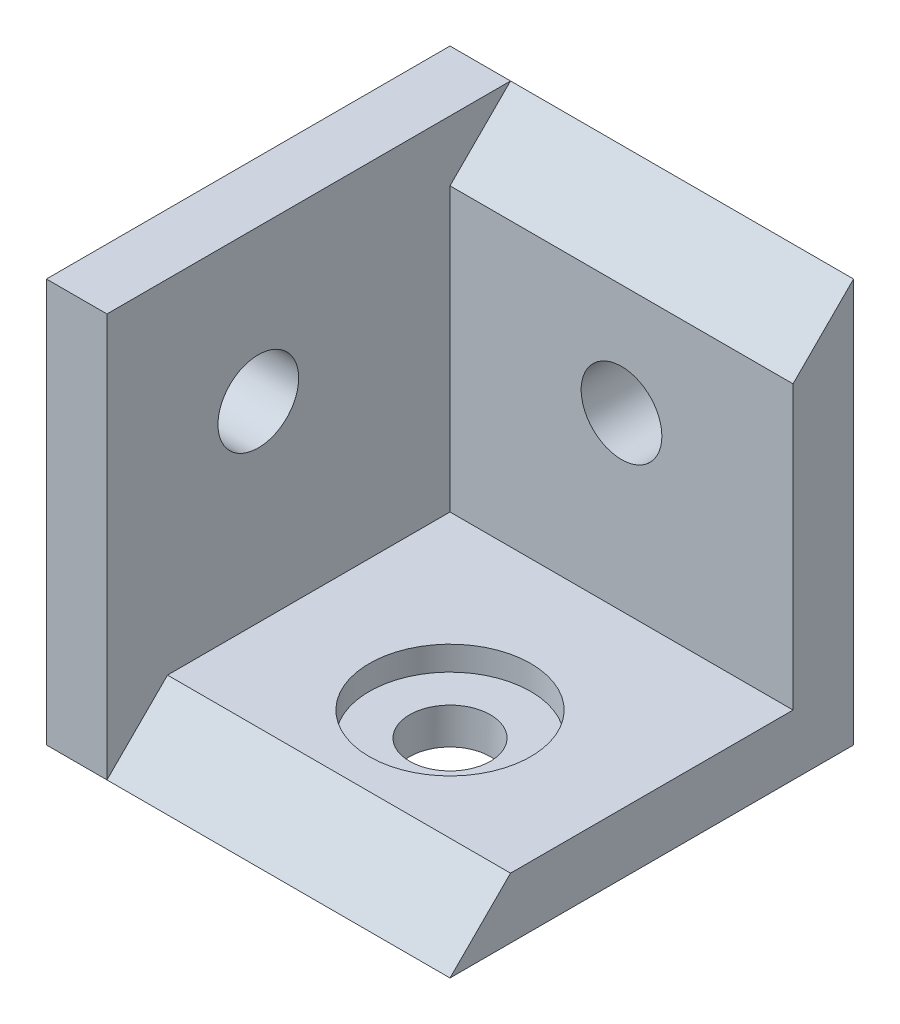
ISO-10303-21;
HEADER;
FILE_DESCRIPTION(('STEP AP214'),'2;1');
FILE_NAME('part.step','',(''),(''),'','','');
FILE_SCHEMA(('AUTOMOTIVE_DESIGN { 1 0 10303 214 1 1 1 1 }'));
ENDSEC;
DATA;
#1=APPLICATION_CONTEXT('core data for automotive mechanical design processes');
#2=APPLICATION_PROTOCOL_DEFINITION('international standard','automotive_design',2000,#1);
#3=PRODUCT_CONTEXT('',#1,'mechanical');
#4=PRODUCT('Part','Part','',(#3));
#5=PRODUCT_RELATED_PRODUCT_CATEGORY('part','',(#4));
#6=PRODUCT_DEFINITION_FORMATION('','',#4);
#7=PRODUCT_DEFINITION_CONTEXT('part definition',#1,'design');
#8=PRODUCT_DEFINITION('design','',#6,#7);
#9=PRODUCT_DEFINITION_SHAPE('','',#8);
#10=(LENGTH_UNIT() NAMED_UNIT(*) SI_UNIT(.MILLI.,.METRE.));
#11=(NAMED_UNIT(*) PLANE_ANGLE_UNIT() SI_UNIT($,.RADIAN.));
#12=(NAMED_UNIT(*) SI_UNIT($,.STERADIAN.) SOLID_ANGLE_UNIT());
#13=UNCERTAINTY_MEASURE_WITH_UNIT(LENGTH_MEASURE(1.E-05),#10,'distance_accuracy_value','');
#14=(GEOMETRIC_REPRESENTATION_CONTEXT(3) GLOBAL_UNCERTAINTY_ASSIGNED_CONTEXT((#13)) GLOBAL_UNIT_ASSIGNED_CONTEXT((#10,
#11,#12)) REPRESENTATION_CONTEXT('',''));
#15=CARTESIAN_POINT('',(0.,0.,0.));
#16=DIRECTION('',(0.,0.,1.));
#17=DIRECTION('',(1.,0.,0.));
#18=AXIS2_PLACEMENT_3D('',#15,#16,#17);
#19=CARTESIAN_POINT('',(11.5,-14.,-8.5));
#20=DIRECTION('',(0.,1.,0.));
#21=DIRECTION('',(0.,0.,1.));
#22=AXIS2_PLACEMENT_3D('',#19,#20,#21);
#23=CYLINDRICAL_SURFACE('',#22,2.);
#24=CARTESIAN_POINT('',(11.5,0.,-8.5));
#25=DIRECTION('',(0.,-1.,0.));
#26=DIRECTION('',(0.,0.,-1.));
#27=AXIS2_PLACEMENT_3D('',#24,#25,#26);
#28=CIRCLE('',#27,2.);
#29=CARTESIAN_POINT('',(11.5,0.,-10.5));
#30=VERTEX_POINT('',#29);
#31=EDGE_CURVE('E377',#30,#30,#28,.T.);
#32=ORIENTED_EDGE('',*,*,#31,.T.);
#33=EDGE_LOOP('',(#32));
#34=FACE_BOUND('',#33,.T.);
#35=CARTESIAN_POINT('',(11.5,1.8,-8.5));
#36=DIRECTION('',(0.,1.,0.));
#37=DIRECTION('',(0.,0.,1.));
#38=AXIS2_PLACEMENT_3D('',#35,#36,#37);
#39=CIRCLE('',#38,2.);
#40=CARTESIAN_POINT('',(11.5,1.8,-6.5));
#41=VERTEX_POINT('',#40);
#42=EDGE_CURVE('E49',#41,#41,#39,.F.);
#43=ORIENTED_EDGE('',*,*,#42,.F.);
#44=EDGE_LOOP('',(#43));
#45=FACE_BOUND('',#44,.T.);
#46=ADVANCED_FACE('F45',(#34,#45),#23,.F.);
#47=CARTESIAN_POINT('',(3.,20.,-20.));
#48=DIRECTION('',(0.,-0.707106781186547,-0.707106781186547));
#49=DIRECTION('',(0.,0.707106781186548,-0.707106781186548));
#50=AXIS2_PLACEMENT_3D('',#47,#48,#49);
#51=PLANE('',#50);
#52=DIRECTION('',(0.,0.707106781186548,-0.707106781186548));
#53=VECTOR('',#52,1.);
#54=CARTESIAN_POINT('',(3.,20.,-20.));
#55=LINE('',#54,#53);
#56=CARTESIAN_POINT('',(3.,17.,-17.));
#57=VERTEX_POINT('',#56);
#58=CARTESIAN_POINT('',(3.,20.,-20.));
#59=VERTEX_POINT('',#58);
#60=EDGE_CURVE('E153',#57,#59,#55,.T.);
#61=ORIENTED_EDGE('',*,*,#60,.F.);
#62=DIRECTION('',(1.,0.,0.));
#63=VECTOR('',#62,1.);
#64=CARTESIAN_POINT('',(3.,17.,-17.));
#65=LINE('',#64,#63);
#66=CARTESIAN_POINT('',(20.,17.,-17.));
#67=VERTEX_POINT('',#66);
#68=EDGE_CURVE('E129',#57,#67,#65,.T.);
#69=ORIENTED_EDGE('',*,*,#68,.T.);
#70=DIRECTION('',(0.,0.707106781186548,-0.707106781186548));
#71=VECTOR('',#70,1.);
#72=CARTESIAN_POINT('',(20.,20.,-20.));
#73=LINE('',#72,#71);
#74=CARTESIAN_POINT('',(20.,20.,-20.));
#75=VERTEX_POINT('',#74);
#76=EDGE_CURVE('E146',#67,#75,#73,.T.);
#77=ORIENTED_EDGE('',*,*,#76,.T.);
#78=DIRECTION('',(-1.,0.,0.));
#79=VECTOR('',#78,1.);
#80=CARTESIAN_POINT('',(0.,20.,-20.));
#81=LINE('',#80,#79);
#82=EDGE_CURVE('E173',#75,#59,#81,.T.);
#83=ORIENTED_EDGE('',*,*,#82,.T.);
#84=EDGE_LOOP('',(#61,#69,#77,#83));
#85=FACE_BOUND('',#84,.T.);
#86=ADVANCED_FACE('F218',(#85),#51,.F.);
#87=CARTESIAN_POINT('',(0.,20.,0.));
#88=DIRECTION('',(0.,0.,-1.));
#89=DIRECTION('',(-1.,0.,0.));
#90=AXIS2_PLACEMENT_3D('',#87,#88,#89);
#91=PLANE('',#90);
#92=DIRECTION('',(0.,-1.,0.));
#93=VECTOR('',#92,1.);
#94=CARTESIAN_POINT('',(3.,0.,0.));
#95=LINE('',#94,#93);
#96=CARTESIAN_POINT('',(3.,20.,0.));
#97=VERTEX_POINT('',#96);
#98=CARTESIAN_POINT('',(3.,0.,0.));
#99=VERTEX_POINT('',#98);
#100=EDGE_CURVE('E69',#97,#99,#95,.T.);
#101=ORIENTED_EDGE('',*,*,#100,.F.);
#102=DIRECTION('',(1.,0.,0.));
#103=VECTOR('',#102,1.);
#104=CARTESIAN_POINT('',(0.,20.,0.));
#105=LINE('',#104,#103);
#106=CARTESIAN_POINT('',(0.,20.,0.));
#107=VERTEX_POINT('',#106);
#108=EDGE_CURVE('E167',#107,#97,#105,.T.);
#109=ORIENTED_EDGE('',*,*,#108,.F.);
#110=DIRECTION('',(0.,-1.,0.));
#111=VECTOR('',#110,1.);
#112=CARTESIAN_POINT('',(0.,20.,0.));
#113=LINE('',#112,#111);
#114=CARTESIAN_POINT('',(0.,0.,0.));
#115=VERTEX_POINT('',#114);
#116=EDGE_CURVE('E11',#107,#115,#113,.T.);
#117=ORIENTED_EDGE('',*,*,#116,.T.);
#118=DIRECTION('',(1.,0.,0.));
#119=VECTOR('',#118,1.);
#120=CARTESIAN_POINT('',(0.,0.,0.));
#121=LINE('',#120,#119);
#122=EDGE_CURVE('E181',#115,#99,#121,.T.);
#123=ORIENTED_EDGE('',*,*,#122,.T.);
#124=EDGE_LOOP('',(#101,#109,#117,#123));
#125=FACE_BOUND('',#124,.T.);
#126=ADVANCED_FACE('F224',(#125),#91,.F.);
#127=CARTESIAN_POINT('',(0.,20.,0.));
#128=DIRECTION('',(0.,-1.,0.));
#129=DIRECTION('',(0.,0.,-1.));
#130=AXIS2_PLACEMENT_3D('',#127,#128,#129);
#131=PLANE('',#130);
#132=DIRECTION('',(0.,0.,1.));
#133=VECTOR('',#132,1.);
#134=CARTESIAN_POINT('',(3.,20.,0.));
#135=LINE('',#134,#133);
#136=EDGE_CURVE('E147',#59,#97,#135,.T.);
#137=ORIENTED_EDGE('',*,*,#136,.F.);
#138=CARTESIAN_POINT('',(0.,20.,-20.));
#139=VERTEX_POINT('',#138);
#140=EDGE_CURVE('E172',#59,#139,#81,.T.);
#141=ORIENTED_EDGE('',*,*,#140,.T.);
#142=DIRECTION('',(0.,0.,1.));
#143=VECTOR('',#142,1.);
#144=CARTESIAN_POINT('',(0.,20.,0.));
#145=LINE('',#144,#143);
#146=EDGE_CURVE('E163',#139,#107,#145,.T.);
#147=ORIENTED_EDGE('',*,*,#146,.T.);
#148=ORIENTED_EDGE('',*,*,#108,.T.);
#149=EDGE_LOOP('',(#137,#141,#147,#148));
#150=FACE_BOUND('',#149,.T.);
#151=ADVANCED_FACE('F225',(#150),#131,.F.);
#152=CARTESIAN_POINT('',(0.,20.,0.));
#153=DIRECTION('',(1.,0.,0.));
#154=DIRECTION('',(0.,0.,-1.));
#155=AXIS2_PLACEMENT_3D('',#152,#153,#154);
#156=PLANE('',#155);
#157=CARTESIAN_POINT('',(0.,12.5,-7.5));
#158=DIRECTION('',(1.,0.,0.));
#159=DIRECTION('',(0.,0.,-1.));
#160=AXIS2_PLACEMENT_3D('',#157,#158,#159);
#161=CIRCLE('',#160,2.);
#162=CARTESIAN_POINT('',(0.,12.5,-9.5));
#163=VERTEX_POINT('',#162);
#164=EDGE_CURVE('E137',#163,#163,#161,.T.);
#165=ORIENTED_EDGE('',*,*,#164,.T.);
#166=EDGE_LOOP('',(#165));
#167=FACE_BOUND('',#166,.T.);
#168=DIRECTION('',(0.,0.,1.));
#169=VECTOR('',#168,1.);
#170=CARTESIAN_POINT('',(0.,0.,0.));
#171=LINE('',#170,#169);
#172=CARTESIAN_POINT('',(0.,0.,-20.));
#173=VERTEX_POINT('',#172);
#174=EDGE_CURVE('E162',#173,#115,#171,.T.);
#175=ORIENTED_EDGE('',*,*,#174,.T.);
#176=ORIENTED_EDGE('',*,*,#116,.F.);
#177=ORIENTED_EDGE('',*,*,#146,.F.);
#178=DIRECTION('',(0.,-1.,0.));
#179=VECTOR('',#178,1.);
#180=CARTESIAN_POINT('',(0.,20.,-20.));
#181=LINE('',#180,#179);
#182=EDGE_CURVE('E177',#139,#173,#181,.T.);
#183=ORIENTED_EDGE('',*,*,#182,.T.);
#184=EDGE_LOOP('',(#175,#176,#177,#183));
#185=FACE_BOUND('',#184,.T.);
#186=ADVANCED_FACE('F47',(#167,#185),#156,.F.);
#187=CARTESIAN_POINT('',(20.,20.,0.));
#188=DIRECTION('',(-1.,0.,0.));
#189=DIRECTION('',(0.,0.,1.));
#190=AXIS2_PLACEMENT_3D('',#187,#188,#189);
#191=PLANE('',#190);
#192=ORIENTED_EDGE('',*,*,#76,.F.);
#193=DIRECTION('',(0.,1.,0.));
#194=VECTOR('',#193,1.);
#195=CARTESIAN_POINT('',(20.,3.,-17.));
#196=LINE('',#195,#194);
#197=CARTESIAN_POINT('',(20.,3.,-17.));
#198=VERTEX_POINT('',#197);
#199=EDGE_CURVE('E134',#198,#67,#196,.T.);
#200=ORIENTED_EDGE('',*,*,#199,.F.);
#201=DIRECTION('',(0.,0.,-1.));
#202=VECTOR('',#201,1.);
#203=CARTESIAN_POINT('',(20.,3.,-17.));
#204=LINE('',#203,#202);
#205=CARTESIAN_POINT('',(20.,3.,-3.));
#206=VERTEX_POINT('',#205);
#207=EDGE_CURVE('E121',#206,#198,#204,.T.);
#208=ORIENTED_EDGE('',*,*,#207,.F.);
#209=CARTESIAN_POINT('',(20.,0.,0.));
#210=VERTEX_POINT('',#209);
#211=EDGE_CURVE('E150',#210,#206,#73,.T.);
#212=ORIENTED_EDGE('',*,*,#211,.F.);
#213=DIRECTION('',(0.,0.,-1.));
#214=VECTOR('',#213,1.);
#215=CARTESIAN_POINT('',(20.,0.,0.));
#216=LINE('',#215,#214);
#217=CARTESIAN_POINT('',(20.,0.,-20.));
#218=VERTEX_POINT('',#217);
#219=EDGE_CURVE('E185',#210,#218,#216,.T.);
#220=ORIENTED_EDGE('',*,*,#219,.T.);
#221=DIRECTION('',(0.,-1.,0.));
#222=VECTOR('',#221,1.);
#223=CARTESIAN_POINT('',(20.,20.,-20.));
#224=LINE('',#223,#222);
#225=EDGE_CURVE('E55',#75,#218,#224,.T.);
#226=ORIENTED_EDGE('',*,*,#225,.F.);
#227=EDGE_LOOP('',(#192,#200,#208,#212,#220,#226));
#228=FACE_BOUND('',#227,.T.);
#229=ADVANCED_FACE('F219',(#228),#191,.F.);
#230=CARTESIAN_POINT('',(0.,20.,-20.));
#231=DIRECTION('',(0.,0.,1.));
#232=DIRECTION('',(1.,0.,0.));
#233=AXIS2_PLACEMENT_3D('',#230,#231,#232);
#234=PLANE('',#233);
#235=CARTESIAN_POINT('',(11.5,11.5,-20.));
#236=DIRECTION('',(0.,0.,1.));
#237=DIRECTION('',(1.,0.,0.));
#238=AXIS2_PLACEMENT_3D('',#235,#236,#237);
#239=CIRCLE('',#238,2.);
#240=CARTESIAN_POINT('',(13.5,11.5,-20.));
#241=VERTEX_POINT('',#240);
#242=EDGE_CURVE('E384',#241,#241,#239,.T.);
#243=ORIENTED_EDGE('',*,*,#242,.T.);
#244=EDGE_LOOP('',(#243));
#245=FACE_BOUND('',#244,.T.);
#246=DIRECTION('',(-1.,0.,0.));
#247=VECTOR('',#246,1.);
#248=CARTESIAN_POINT('',(0.,0.,-20.));
#249=LINE('',#248,#247);
#250=EDGE_CURVE('E168',#218,#173,#249,.T.);
#251=ORIENTED_EDGE('',*,*,#250,.T.);
#252=ORIENTED_EDGE('',*,*,#182,.F.);
#253=ORIENTED_EDGE('',*,*,#140,.F.);
#254=ORIENTED_EDGE('',*,*,#82,.F.);
#255=ORIENTED_EDGE('',*,*,#225,.T.);
#256=EDGE_LOOP('',(#251,#252,#253,#254,#255));
#257=FACE_BOUND('',#256,.T.);
#258=ADVANCED_FACE('F199',(#245,#257),#234,.F.);
#259=CARTESIAN_POINT('',(0.,0.,0.));
#260=DIRECTION('',(0.,-1.,0.));
#261=DIRECTION('',(0.,0.,-1.));
#262=AXIS2_PLACEMENT_3D('',#259,#260,#261);
#263=PLANE('',#262);
#264=ORIENTED_EDGE('',*,*,#31,.F.);
#265=EDGE_LOOP('',(#264));
#266=FACE_BOUND('',#265,.T.);
#267=ORIENTED_EDGE('',*,*,#174,.F.);
#268=ORIENTED_EDGE('',*,*,#250,.F.);
#269=ORIENTED_EDGE('',*,*,#219,.F.);
#270=DIRECTION('',(1.,0.,0.));
#271=VECTOR('',#270,1.);
#272=CARTESIAN_POINT('',(3.,0.,0.));
#273=LINE('',#272,#271);
#274=EDGE_CURVE('E156',#99,#210,#273,.T.);
#275=ORIENTED_EDGE('',*,*,#274,.F.);
#276=ORIENTED_EDGE('',*,*,#122,.F.);
#277=EDGE_LOOP('',(#267,#268,#269,#275,#276));
#278=FACE_BOUND('',#277,.T.);
#279=ADVANCED_FACE('F207',(#266,#278),#263,.T.);
#280=ORIENTED_EDGE('',*,*,#211,.T.);
#281=DIRECTION('',(-1.,0.,0.));
#282=VECTOR('',#281,1.);
#283=CARTESIAN_POINT('',(3.,3.,-3.));
#284=LINE('',#283,#282);
#285=CARTESIAN_POINT('',(3.,3.,-3.));
#286=VERTEX_POINT('',#285);
#287=EDGE_CURVE('E125',#206,#286,#284,.T.);
#288=ORIENTED_EDGE('',*,*,#287,.T.);
#289=EDGE_CURVE('E112',#99,#286,#55,.T.);
#290=ORIENTED_EDGE('',*,*,#289,.F.);
#291=ORIENTED_EDGE('',*,*,#274,.T.);
#292=EDGE_LOOP('',(#280,#288,#290,#291));
#293=FACE_BOUND('',#292,.T.);
#294=ADVANCED_FACE('F222',(#293),#51,.F.);
#295=CARTESIAN_POINT('',(3.,0.,0.));
#296=DIRECTION('',(1.,0.,0.));
#297=DIRECTION('',(0.,0.,-1.));
#298=AXIS2_PLACEMENT_3D('',#295,#296,#297);
#299=PLANE('',#298);
#300=CARTESIAN_POINT('',(3.,12.5,-7.5));
#301=DIRECTION('',(1.,0.,0.));
#302=DIRECTION('',(0.,0.,-1.));
#303=AXIS2_PLACEMENT_3D('',#300,#301,#302);
#304=CIRCLE('',#303,2.);
#305=CARTESIAN_POINT('',(3.,12.5,-9.5));
#306=VERTEX_POINT('',#305);
#307=EDGE_CURVE('E387',#306,#306,#304,.T.);
#308=ORIENTED_EDGE('',*,*,#307,.F.);
#309=EDGE_LOOP('',(#308));
#310=FACE_BOUND('',#309,.T.);
#311=ORIENTED_EDGE('',*,*,#289,.T.);
#312=DIRECTION('',(0.,0.,-1.));
#313=VECTOR('',#312,1.);
#314=CARTESIAN_POINT('',(3.,3.,-17.));
#315=LINE('',#314,#313);
#316=CARTESIAN_POINT('',(3.,3.,-17.));
#317=VERTEX_POINT('',#316);
#318=EDGE_CURVE('E109',#286,#317,#315,.T.);
#319=ORIENTED_EDGE('',*,*,#318,.T.);
#320=DIRECTION('',(0.,1.,0.));
#321=VECTOR('',#320,1.);
#322=CARTESIAN_POINT('',(3.,3.,-17.));
#323=LINE('',#322,#321);
#324=EDGE_CURVE('E62',#317,#57,#323,.T.);
#325=ORIENTED_EDGE('',*,*,#324,.T.);
#326=ORIENTED_EDGE('',*,*,#60,.T.);
#327=ORIENTED_EDGE('',*,*,#136,.T.);
#328=ORIENTED_EDGE('',*,*,#100,.T.);
#329=EDGE_LOOP('',(#311,#319,#325,#326,#327,#328));
#330=FACE_BOUND('',#329,.T.);
#331=ADVANCED_FACE('F111',(#310,#330),#299,.T.);
#332=CARTESIAN_POINT('',(3.,3.,-17.));
#333=DIRECTION('',(0.,0.,-1.));
#334=DIRECTION('',(-1.,0.,0.));
#335=AXIS2_PLACEMENT_3D('',#332,#333,#334);
#336=PLANE('',#335);
#337=CARTESIAN_POINT('',(11.5,11.5,-17.));
#338=DIRECTION('',(0.,0.,1.));
#339=DIRECTION('',(1.,0.,0.));
#340=AXIS2_PLACEMENT_3D('',#337,#338,#339);
#341=CIRCLE('',#340,2.);
#342=CARTESIAN_POINT('',(13.5,11.5,-17.));
#343=VERTEX_POINT('',#342);
#344=EDGE_CURVE('E380',#343,#343,#341,.T.);
#345=ORIENTED_EDGE('',*,*,#344,.F.);
#346=EDGE_LOOP('',(#345));
#347=FACE_BOUND('',#346,.T.);
#348=ORIENTED_EDGE('',*,*,#324,.F.);
#349=DIRECTION('',(1.,0.,0.));
#350=VECTOR('',#349,1.);
#351=CARTESIAN_POINT('',(3.,3.,-17.));
#352=LINE('',#351,#350);
#353=EDGE_CURVE('E116',#317,#198,#352,.T.);
#354=ORIENTED_EDGE('',*,*,#353,.T.);
#355=ORIENTED_EDGE('',*,*,#199,.T.);
#356=ORIENTED_EDGE('',*,*,#68,.F.);
#357=EDGE_LOOP('',(#348,#354,#355,#356));
#358=FACE_BOUND('',#357,.T.);
#359=ADVANCED_FACE('F127',(#347,#358),#336,.F.);
#360=CARTESIAN_POINT('',(3.,3.,-17.));
#361=DIRECTION('',(0.,-1.,0.));
#362=DIRECTION('',(0.,0.,-1.));
#363=AXIS2_PLACEMENT_3D('',#360,#361,#362);
#364=PLANE('',#363);
#365=CARTESIAN_POINT('',(11.5,3.,-8.5));
#366=DIRECTION('',(0.,1.,0.));
#367=DIRECTION('',(0.,0.,1.));
#368=AXIS2_PLACEMENT_3D('',#365,#366,#367);
#369=CIRCLE('',#368,4.);
#370=CARTESIAN_POINT('',(11.5,3.,-4.5));
#371=VERTEX_POINT('',#370);
#372=EDGE_CURVE('E371',#371,#371,#369,.T.);
#373=ORIENTED_EDGE('',*,*,#372,.F.);
#374=EDGE_LOOP('',(#373));
#375=FACE_BOUND('',#374,.T.);
#376=ORIENTED_EDGE('',*,*,#207,.T.);
#377=ORIENTED_EDGE('',*,*,#353,.F.);
#378=ORIENTED_EDGE('',*,*,#318,.F.);
#379=ORIENTED_EDGE('',*,*,#287,.F.);
#380=EDGE_LOOP('',(#376,#377,#378,#379));
#381=FACE_BOUND('',#380,.T.);
#382=ADVANCED_FACE('F119',(#375,#381),#364,.F.);
#383=CARTESIAN_POINT('',(-14.,12.5,-7.5));
#384=DIRECTION('',(1.,0.,0.));
#385=DIRECTION('',(0.,0.,-1.));
#386=AXIS2_PLACEMENT_3D('',#383,#384,#385);
#387=CYLINDRICAL_SURFACE('',#386,2.);
#388=ORIENTED_EDGE('',*,*,#307,.T.);
#389=EDGE_LOOP('',(#388));
#390=FACE_BOUND('',#389,.T.);
#391=ORIENTED_EDGE('',*,*,#164,.F.);
#392=EDGE_LOOP('',(#391));
#393=FACE_BOUND('',#392,.T.);
#394=ADVANCED_FACE('F254',(#390,#393),#387,.F.);
#395=CARTESIAN_POINT('',(11.5,11.5,-34.));
#396=DIRECTION('',(0.,0.,1.));
#397=DIRECTION('',(1.,0.,0.));
#398=AXIS2_PLACEMENT_3D('',#395,#396,#397);
#399=CYLINDRICAL_SURFACE('',#398,2.);
#400=ORIENTED_EDGE('',*,*,#344,.T.);
#401=EDGE_LOOP('',(#400));
#402=FACE_BOUND('',#401,.T.);
#403=ORIENTED_EDGE('',*,*,#242,.F.);
#404=EDGE_LOOP('',(#403));
#405=FACE_BOUND('',#404,.T.);
#406=ADVANCED_FACE('F250',(#402,#405),#399,.F.);
#407=CARTESIAN_POINT('',(11.5,1.8,-8.5));
#408=DIRECTION('',(0.,1.,0.));
#409=DIRECTION('',(0.,0.,1.));
#410=AXIS2_PLACEMENT_3D('',#407,#408,#409);
#411=PLANE('',#410);
#412=CARTESIAN_POINT('',(11.5,1.8,-8.5));
#413=DIRECTION('',(0.,1.,0.));
#414=DIRECTION('',(0.,0.,1.));
#415=AXIS2_PLACEMENT_3D('',#412,#413,#414);
#416=CIRCLE('',#415,4.);
#417=CARTESIAN_POINT('',(11.5,1.8,-4.5));
#418=VERTEX_POINT('',#417);
#419=EDGE_CURVE('E368',#418,#418,#416,.T.);
#420=ORIENTED_EDGE('',*,*,#419,.T.);
#421=EDGE_LOOP('',(#420));
#422=FACE_BOUND('',#421,.T.);
#423=ORIENTED_EDGE('',*,*,#42,.T.);
#424=EDGE_LOOP('',(#423));
#425=FACE_BOUND('',#424,.T.);
#426=ADVANCED_FACE('F253',(#422,#425),#411,.T.);
#427=CARTESIAN_POINT('',(11.5,1.8,-8.5));
#428=DIRECTION('',(0.,1.,0.));
#429=DIRECTION('',(0.,0.,1.));
#430=AXIS2_PLACEMENT_3D('',#427,#428,#429);
#431=CYLINDRICAL_SURFACE('',#430,4.);
#432=ORIENTED_EDGE('',*,*,#419,.F.);
#433=EDGE_LOOP('',(#432));
#434=FACE_BOUND('',#433,.T.);
#435=ORIENTED_EDGE('',*,*,#372,.T.);
#436=EDGE_LOOP('',(#435));
#437=FACE_BOUND('',#436,.T.);
#438=ADVANCED_FACE('F248',(#434,#437),#431,.F.);
#439=CLOSED_SHELL('',(#46,#86,#126,#151,#186,#229,#258,#279,#294,#331,#359,#382,#394,#406,#426,#438));
#440=MANIFOLD_SOLID_BREP('B2',#439);
#441=ADVANCED_BREP_SHAPE_REPRESENTATION('',(#18,#440),#14);
#442=SHAPE_DEFINITION_REPRESENTATION(#9,#441);
ENDSEC;
END-ISO-10303-21;
